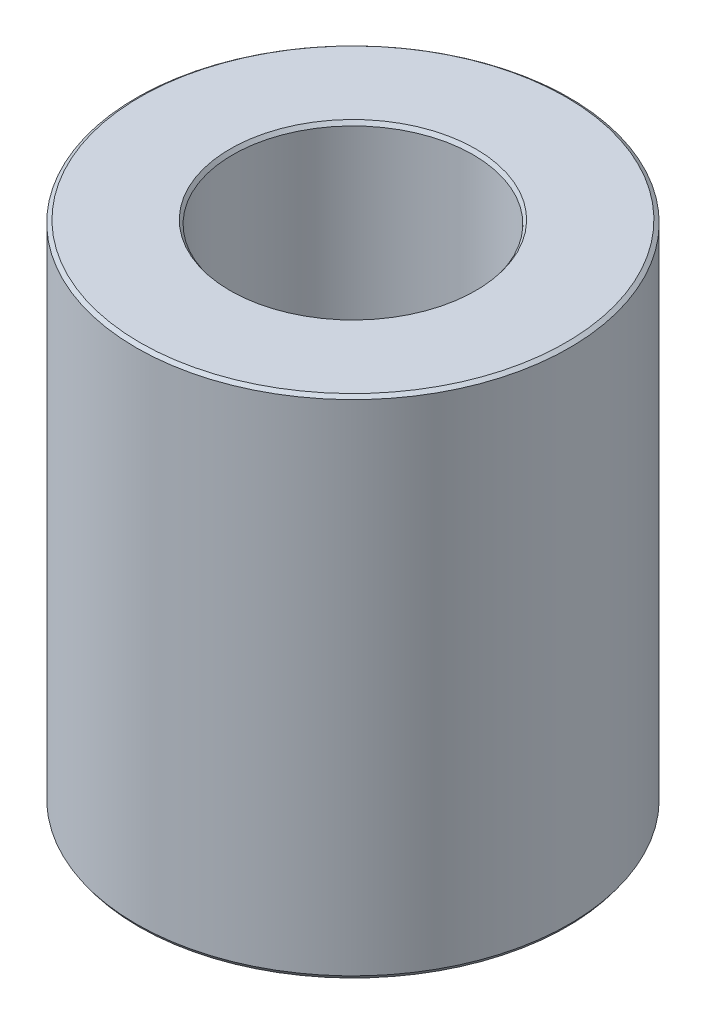
ISO-10303-21;
HEADER;
FILE_DESCRIPTION(('STEP AP214'),'2;1');
FILE_NAME('part.step','',(''),(''),'','','');
FILE_SCHEMA(('AUTOMOTIVE_DESIGN { 1 0 10303 214 1 1 1 1 }'));
ENDSEC;
DATA;
#1=APPLICATION_CONTEXT('core data for automotive mechanical design processes');
#2=APPLICATION_PROTOCOL_DEFINITION('international standard','automotive_design',2000,#1);
#3=PRODUCT_CONTEXT('',#1,'mechanical');
#4=PRODUCT('Part','Part','',(#3));
#5=PRODUCT_RELATED_PRODUCT_CATEGORY('part','',(#4));
#6=PRODUCT_DEFINITION_FORMATION('','',#4);
#7=PRODUCT_DEFINITION_CONTEXT('part definition',#1,'design');
#8=PRODUCT_DEFINITION('design','',#6,#7);
#9=PRODUCT_DEFINITION_SHAPE('','',#8);
#10=(LENGTH_UNIT() NAMED_UNIT(*) SI_UNIT(.MILLI.,.METRE.));
#11=(NAMED_UNIT(*) PLANE_ANGLE_UNIT() SI_UNIT($,.RADIAN.));
#12=(NAMED_UNIT(*) SI_UNIT($,.STERADIAN.) SOLID_ANGLE_UNIT());
#13=UNCERTAINTY_MEASURE_WITH_UNIT(LENGTH_MEASURE(1.E-05),#10,'distance_accuracy_value','');
#14=(GEOMETRIC_REPRESENTATION_CONTEXT(3) GLOBAL_UNCERTAINTY_ASSIGNED_CONTEXT((#13)) GLOBAL_UNIT_ASSIGNED_CONTEXT((#10,
#11,#12)) REPRESENTATION_CONTEXT('',''));
#15=CARTESIAN_POINT('',(0.,0.,0.));
#16=DIRECTION('',(0.,0.,1.));
#17=DIRECTION('',(1.,0.,0.));
#18=AXIS2_PLACEMENT_3D('',#15,#16,#17);
#19=CARTESIAN_POINT('',(0.,99.1883469062526,0.));
#20=DIRECTION('',(0.,-1.,0.));
#21=DIRECTION('',(0.,0.,-1.));
#22=AXIS2_PLACEMENT_3D('',#19,#20,#21);
#23=CYLINDRICAL_SURFACE('',#22,42.5);
#24=CARTESIAN_POINT('',(0.,0.728502608173573,0.));
#25=DIRECTION('',(0.,1.,0.));
#26=DIRECTION('',(0.,0.,1.));
#27=AXIS2_PLACEMENT_3D('',#24,#25,#26);
#28=CIRCLE('',#27,42.5);
#29=CARTESIAN_POINT('',(0.,0.728502608173573,42.5));
#30=VERTEX_POINT('',#29);
#31=EDGE_CURVE('E10',#30,#30,#28,.T.);
#32=ORIENTED_EDGE('',*,*,#31,.T.);
#33=EDGE_LOOP('',(#32));
#34=FACE_BOUND('',#33,.T.);
#35=CARTESIAN_POINT('',(0.,98.6687528236634,0.));
#36=DIRECTION('',(0.,1.,0.));
#37=DIRECTION('',(0.,0.,1.));
#38=AXIS2_PLACEMENT_3D('',#35,#36,#37);
#39=CIRCLE('',#38,42.5);
#40=CARTESIAN_POINT('',(0.,98.6687528236634,42.5));
#41=VERTEX_POINT('',#40);
#42=EDGE_CURVE('E50',#41,#41,#39,.F.);
#43=ORIENTED_EDGE('',*,*,#42,.T.);
#44=EDGE_LOOP('',(#43));
#45=FACE_BOUND('',#44,.T.);
#46=ADVANCED_FACE('F39',(#34,#45),#23,.T.);
#47=CARTESIAN_POINT('',(0.,99.1883469062526,0.));
#48=DIRECTION('',(0.,1.,0.));
#49=DIRECTION('',(0.,0.,1.));
#50=AXIS2_PLACEMENT_3D('',#47,#48,#49);
#51=PLANE('',#50);
#52=CARTESIAN_POINT('',(0.,99.1883469062526,0.));
#53=DIRECTION('',(0.,1.,0.));
#54=DIRECTION('',(0.,0.,1.));
#55=AXIS2_PLACEMENT_3D('',#52,#53,#54);
#56=CIRCLE('',#55,24.1015162638214);
#57=CARTESIAN_POINT('',(0.,99.1883469062526,24.1015162638214));
#58=VERTEX_POINT('',#57);
#59=EDGE_CURVE('E58',#58,#58,#56,.F.);
#60=ORIENTED_EDGE('',*,*,#59,.T.);
#61=EDGE_LOOP('',(#60));
#62=FACE_BOUND('',#61,.T.);
#63=CARTESIAN_POINT('',(0.,99.1883469062526,0.));
#64=DIRECTION('',(0.,1.,0.));
#65=DIRECTION('',(0.,0.,1.));
#66=AXIS2_PLACEMENT_3D('',#63,#64,#65);
#67=CIRCLE('',#66,41.7714973918264);
#68=CARTESIAN_POINT('',(0.,99.1883469062526,41.7714973918264));
#69=VERTEX_POINT('',#68);
#70=EDGE_CURVE('E61',#69,#69,#67,.T.);
#71=ORIENTED_EDGE('',*,*,#70,.T.);
#72=EDGE_LOOP('',(#71));
#73=FACE_BOUND('',#72,.T.);
#74=ADVANCED_FACE('F88',(#62,#73),#51,.T.);
#75=CARTESIAN_POINT('',(0.,0.,0.));
#76=DIRECTION('',(0.,1.,0.));
#77=DIRECTION('',(0.,0.,1.));
#78=AXIS2_PLACEMENT_3D('',#75,#76,#77);
#79=PLANE('',#78);
#80=CARTESIAN_POINT('',(0.,0.,0.));
#81=DIRECTION('',(0.,1.,0.));
#82=DIRECTION('',(0.,0.,1.));
#83=AXIS2_PLACEMENT_3D('',#80,#81,#82);
#84=CIRCLE('',#83,24.3104247894058);
#85=CARTESIAN_POINT('',(0.,0.,24.3104247894058));
#86=VERTEX_POINT('',#85);
#87=EDGE_CURVE('E51',#86,#86,#84,.T.);
#88=ORIENTED_EDGE('',*,*,#87,.T.);
#89=EDGE_LOOP('',(#88));
#90=FACE_BOUND('',#89,.T.);
#91=CARTESIAN_POINT('',(0.,0.,0.));
#92=DIRECTION('',(0.,1.,0.));
#93=DIRECTION('',(0.,0.,1.));
#94=AXIS2_PLACEMENT_3D('',#91,#92,#93);
#95=CIRCLE('',#94,41.9804059174108);
#96=CARTESIAN_POINT('',(0.,0.,41.9804059174108));
#97=VERTEX_POINT('',#96);
#98=EDGE_CURVE('E54',#97,#97,#95,.F.);
#99=ORIENTED_EDGE('',*,*,#98,.T.);
#100=EDGE_LOOP('',(#99));
#101=FACE_BOUND('',#100,.T.);
#102=ADVANCED_FACE('F83',(#90,#101),#79,.F.);
#103=CARTESIAN_POINT('',(0.,99.1883469062526,0.));
#104=DIRECTION('',(0.,-1.,0.));
#105=DIRECTION('',(0.,0.,-1.));
#106=AXIS2_PLACEMENT_3D('',#103,#104,#105);
#107=CYLINDRICAL_SURFACE('',#106,23.5819221812322);
#108=CARTESIAN_POINT('',(0.,98.459844298079,0.));
#109=DIRECTION('',(0.,1.,0.));
#110=DIRECTION('',(0.,0.,1.));
#111=AXIS2_PLACEMENT_3D('',#108,#109,#110);
#112=CIRCLE('',#111,23.5819221812322);
#113=CARTESIAN_POINT('',(0.,98.459844298079,23.5819221812322));
#114=VERTEX_POINT('',#113);
#115=EDGE_CURVE('E67',#114,#114,#112,.T.);
#116=ORIENTED_EDGE('',*,*,#115,.T.);
#117=EDGE_LOOP('',(#116));
#118=FACE_BOUND('',#117,.T.);
#119=CARTESIAN_POINT('',(0.,0.519594082589253,0.));
#120=DIRECTION('',(0.,1.,0.));
#121=DIRECTION('',(0.,0.,1.));
#122=AXIS2_PLACEMENT_3D('',#119,#120,#121);
#123=CIRCLE('',#122,23.5819221812322);
#124=CARTESIAN_POINT('',(0.,0.519594082589253,23.5819221812322));
#125=VERTEX_POINT('',#124);
#126=EDGE_CURVE('E69',#125,#125,#123,.F.);
#127=ORIENTED_EDGE('',*,*,#126,.T.);
#128=EDGE_LOOP('',(#127));
#129=FACE_BOUND('',#128,.T.);
#130=ADVANCED_FACE('F71',(#118,#129),#107,.F.);
#131=CARTESIAN_POINT('',(0.,98.459844298079,0.));
#132=DIRECTION('',(0.,1.,0.));
#133=DIRECTION('',(0.,0.,1.));
#134=AXIS2_PLACEMENT_3D('',#131,#132,#133);
#135=CONICAL_SURFACE('',#134,23.5819221812322,0.619553874451693);
#136=ORIENTED_EDGE('',*,*,#59,.F.);
#137=EDGE_LOOP('',(#136));
#138=FACE_BOUND('',#137,.T.);
#139=ORIENTED_EDGE('',*,*,#115,.F.);
#140=EDGE_LOOP('',(#139));
#141=FACE_BOUND('',#140,.T.);
#142=ADVANCED_FACE('F77',(#138,#141),#135,.F.);
#143=CARTESIAN_POINT('',(0.,0.,0.));
#144=DIRECTION('',(0.,-1.,0.));
#145=DIRECTION('',(0.,0.,-1.));
#146=AXIS2_PLACEMENT_3D('',#143,#144,#145);
#147=CONICAL_SURFACE('',#146,24.3104247894058,0.951242452343189);
#148=ORIENTED_EDGE('',*,*,#126,.F.);
#149=EDGE_LOOP('',(#148));
#150=FACE_BOUND('',#149,.T.);
#151=ORIENTED_EDGE('',*,*,#87,.F.);
#152=EDGE_LOOP('',(#151));
#153=FACE_BOUND('',#152,.T.);
#154=ADVANCED_FACE('F73',(#150,#153),#147,.F.);
#155=CARTESIAN_POINT('',(0.,0.728502608173573,0.));
#156=DIRECTION('',(0.,1.,0.));
#157=DIRECTION('',(0.,0.,1.));
#158=AXIS2_PLACEMENT_3D('',#155,#156,#157);
#159=CONICAL_SURFACE('',#158,42.5,0.619553874451698);
#160=ORIENTED_EDGE('',*,*,#98,.F.);
#161=EDGE_LOOP('',(#160));
#162=FACE_BOUND('',#161,.T.);
#163=ORIENTED_EDGE('',*,*,#31,.F.);
#164=EDGE_LOOP('',(#163));
#165=FACE_BOUND('',#164,.T.);
#166=ADVANCED_FACE('F76',(#162,#165),#159,.T.);
#167=CARTESIAN_POINT('',(0.,99.1883469062526,0.));
#168=DIRECTION('',(0.,-1.,0.));
#169=DIRECTION('',(0.,0.,-1.));
#170=AXIS2_PLACEMENT_3D('',#167,#168,#169);
#171=CONICAL_SURFACE('',#170,41.7714973918264,0.951242452343195);
#172=ORIENTED_EDGE('',*,*,#42,.F.);
#173=EDGE_LOOP('',(#172));
#174=FACE_BOUND('',#173,.T.);
#175=ORIENTED_EDGE('',*,*,#70,.F.);
#176=EDGE_LOOP('',(#175));
#177=FACE_BOUND('',#176,.T.);
#178=ADVANCED_FACE('F45',(#174,#177),#171,.T.);
#179=CLOSED_SHELL('',(#46,#74,#102,#130,#142,#154,#166,#178));
#180=MANIFOLD_SOLID_BREP('B2',#179);
#181=ADVANCED_BREP_SHAPE_REPRESENTATION('',(#18,#180),#14);
#182=SHAPE_DEFINITION_REPRESENTATION(#9,#181);
ENDSEC;
END-ISO-10303-21;
